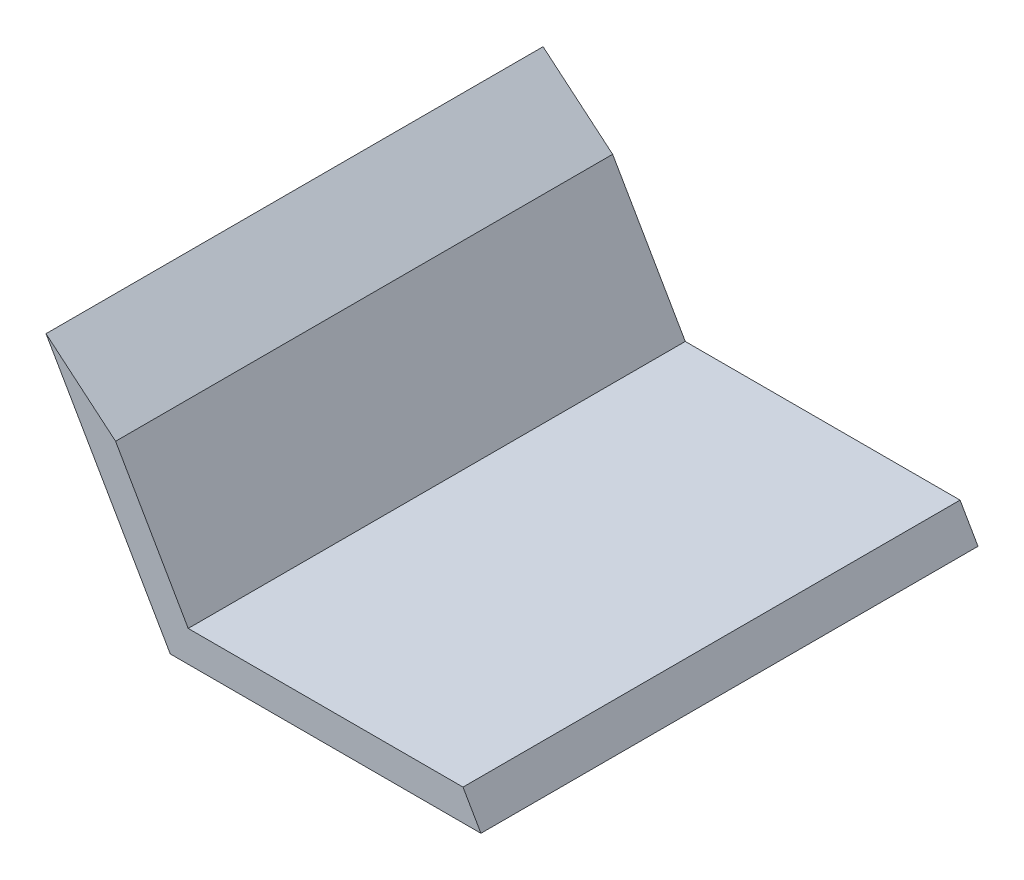
ISO-10303-21;
HEADER;
FILE_DESCRIPTION(('STEP AP214'),'2;1');
FILE_NAME('part.step','',(''),(''),'','','');
FILE_SCHEMA(('AUTOMOTIVE_DESIGN { 1 0 10303 214 1 1 1 1 }'));
ENDSEC;
DATA;
#1=APPLICATION_CONTEXT('core data for automotive mechanical design processes');
#2=APPLICATION_PROTOCOL_DEFINITION('international standard','automotive_design',2000,#1);
#3=PRODUCT_CONTEXT('',#1,'mechanical');
#4=PRODUCT('Part','Part','',(#3));
#5=PRODUCT_RELATED_PRODUCT_CATEGORY('part','',(#4));
#6=PRODUCT_DEFINITION_FORMATION('','',#4);
#7=PRODUCT_DEFINITION_CONTEXT('part definition',#1,'design');
#8=PRODUCT_DEFINITION('design','',#6,#7);
#9=PRODUCT_DEFINITION_SHAPE('','',#8);
#10=(LENGTH_UNIT() NAMED_UNIT(*) SI_UNIT(.MILLI.,.METRE.));
#11=(NAMED_UNIT(*) PLANE_ANGLE_UNIT() SI_UNIT($,.RADIAN.));
#12=(NAMED_UNIT(*) SI_UNIT($,.STERADIAN.) SOLID_ANGLE_UNIT());
#13=UNCERTAINTY_MEASURE_WITH_UNIT(LENGTH_MEASURE(1.E-05),#10,'distance_accuracy_value','');
#14=(GEOMETRIC_REPRESENTATION_CONTEXT(3) GLOBAL_UNCERTAINTY_ASSIGNED_CONTEXT((#13)) GLOBAL_UNIT_ASSIGNED_CONTEXT((#10,
#11,#12)) REPRESENTATION_CONTEXT('',''));
#15=CARTESIAN_POINT('',(0.,0.,0.));
#16=DIRECTION('',(0.,0.,1.));
#17=DIRECTION('',(1.,0.,0.));
#18=AXIS2_PLACEMENT_3D('',#15,#16,#17);
#19=CARTESIAN_POINT('',(15.875,0.,25.4));
#20=DIRECTION('',(0.,1.,0.));
#21=DIRECTION('',(-1.,0.,0.));
#22=AXIS2_PLACEMENT_3D('',#19,#20,#21);
#23=PLANE('',#22);
#24=DIRECTION('',(1.,0.,0.));
#25=VECTOR('',#24,1.);
#26=CARTESIAN_POINT('',(15.875,0.,0.));
#27=LINE('',#26,#25);
#28=CARTESIAN_POINT('',(0.,0.,0.));
#29=VERTEX_POINT('',#28);
#30=CARTESIAN_POINT('',(15.875,0.,0.));
#31=VERTEX_POINT('',#30);
#32=EDGE_CURVE('E107',#29,#31,#27,.T.);
#33=ORIENTED_EDGE('',*,*,#32,.T.);
#34=DIRECTION('',(0.,0.,-1.));
#35=VECTOR('',#34,1.);
#36=CARTESIAN_POINT('',(15.875,0.,25.4));
#37=LINE('',#36,#35);
#38=CARTESIAN_POINT('',(15.875,0.,25.4));
#39=VERTEX_POINT('',#38);
#40=EDGE_CURVE('E11',#39,#31,#37,.T.);
#41=ORIENTED_EDGE('',*,*,#40,.F.);
#42=DIRECTION('',(1.,0.,0.));
#43=VECTOR('',#42,1.);
#44=CARTESIAN_POINT('',(15.875,0.,25.4));
#45=LINE('',#44,#43);
#46=CARTESIAN_POINT('',(0.,0.,25.4));
#47=VERTEX_POINT('',#46);
#48=EDGE_CURVE('E108',#47,#39,#45,.T.);
#49=ORIENTED_EDGE('',*,*,#48,.F.);
#50=DIRECTION('',(0.,0.,-1.));
#51=VECTOR('',#50,1.);
#52=CARTESIAN_POINT('',(0.,0.,25.4));
#53=LINE('',#52,#51);
#54=EDGE_CURVE('E102',#47,#29,#53,.T.);
#55=ORIENTED_EDGE('',*,*,#54,.T.);
#56=EDGE_LOOP('',(#33,#41,#49,#55));
#57=FACE_BOUND('',#56,.T.);
#58=ADVANCED_FACE('F33',(#57),#23,.F.);
#59=CARTESIAN_POINT('',(15.875,0.,25.4));
#60=DIRECTION('',(-0.866025403784439,-0.499999999999998,0.));
#61=DIRECTION('',(0.499999999999999,-0.86602540378444,0.));
#62=AXIS2_PLACEMENT_3D('',#59,#60,#61);
#63=PLANE('',#62);
#64=DIRECTION('',(-0.499999999999998,0.866025403784439,0.));
#65=VECTOR('',#64,1.);
#66=CARTESIAN_POINT('',(15.875,0.,0.));
#67=LINE('',#66,#65);
#68=CARTESIAN_POINT('',(14.9584564476615,1.5875,0.));
#69=VERTEX_POINT('',#68);
#70=EDGE_CURVE('E125',#31,#69,#67,.T.);
#71=ORIENTED_EDGE('',*,*,#70,.T.);
#72=DIRECTION('',(0.,0.,-1.));
#73=VECTOR('',#72,1.);
#74=CARTESIAN_POINT('',(14.9584564476615,1.5875,25.4));
#75=LINE('',#74,#73);
#76=CARTESIAN_POINT('',(14.9584564476615,1.5875,25.4));
#77=VERTEX_POINT('',#76);
#78=EDGE_CURVE('E40',#77,#69,#75,.T.);
#79=ORIENTED_EDGE('',*,*,#78,.F.);
#80=DIRECTION('',(-0.499999999999998,0.866025403784439,0.));
#81=VECTOR('',#80,1.);
#82=CARTESIAN_POINT('',(15.875,0.,25.4));
#83=LINE('',#82,#81);
#84=EDGE_CURVE('E85',#39,#77,#83,.T.);
#85=ORIENTED_EDGE('',*,*,#84,.F.);
#86=ORIENTED_EDGE('',*,*,#40,.T.);
#87=EDGE_LOOP('',(#71,#79,#85,#86));
#88=FACE_BOUND('',#87,.T.);
#89=ADVANCED_FACE('F143',(#88),#63,.F.);
#90=CARTESIAN_POINT('',(0.916543552338537,1.5875,25.4));
#91=DIRECTION('',(0.,-1.,0.));
#92=DIRECTION('',(0.,0.,-1.));
#93=AXIS2_PLACEMENT_3D('',#90,#91,#92);
#94=PLANE('',#93);
#95=DIRECTION('',(-1.,0.,0.));
#96=VECTOR('',#95,1.);
#97=CARTESIAN_POINT('',(0.916543552338537,1.5875,0.));
#98=LINE('',#97,#96);
#99=CARTESIAN_POINT('',(0.916543552338537,1.5875,0.));
#100=VERTEX_POINT('',#99);
#101=EDGE_CURVE('E112',#69,#100,#98,.T.);
#102=ORIENTED_EDGE('',*,*,#101,.T.);
#103=DIRECTION('',(0.,0.,-1.));
#104=VECTOR('',#103,1.);
#105=CARTESIAN_POINT('',(0.916543552338537,1.5875,25.4));
#106=LINE('',#105,#104);
#107=CARTESIAN_POINT('',(0.916543552338537,1.5875,25.4));
#108=VERTEX_POINT('',#107);
#109=EDGE_CURVE('E101',#108,#100,#106,.T.);
#110=ORIENTED_EDGE('',*,*,#109,.F.);
#111=DIRECTION('',(-1.,0.,0.));
#112=VECTOR('',#111,1.);
#113=CARTESIAN_POINT('',(0.916543552338537,1.5875,25.4));
#114=LINE('',#113,#112);
#115=EDGE_CURVE('E124',#77,#108,#114,.T.);
#116=ORIENTED_EDGE('',*,*,#115,.F.);
#117=ORIENTED_EDGE('',*,*,#78,.T.);
#118=EDGE_LOOP('',(#102,#110,#116,#117));
#119=FACE_BOUND('',#118,.T.);
#120=ADVANCED_FACE('F122',(#119),#94,.F.);
#121=CARTESIAN_POINT('',(-4.51691289532291,10.9985226280624,25.4));
#122=DIRECTION('',(-0.86602540378444,-0.499999999999998,0.));
#123=DIRECTION('',(0.499999999999998,-0.86602540378444,0.));
#124=AXIS2_PLACEMENT_3D('',#121,#122,#123);
#125=PLANE('',#124);
#126=DIRECTION('',(-0.499999999999998,0.86602540378444,0.));
#127=VECTOR('',#126,1.);
#128=CARTESIAN_POINT('',(-4.51691289532291,10.9985226280624,0.));
#129=LINE('',#128,#127);
#130=CARTESIAN_POINT('',(-2.79437446980014,8.01499855706722,0.));
#131=VERTEX_POINT('',#130);
#132=EDGE_CURVE('E109',#100,#131,#129,.T.);
#133=ORIENTED_EDGE('',*,*,#132,.T.);
#134=DIRECTION('',(0.,0.,1.));
#135=VECTOR('',#134,1.);
#136=CARTESIAN_POINT('',(-2.79437446980017,8.01499855706724,0.));
#137=LINE('',#136,#135);
#138=CARTESIAN_POINT('',(-2.79437446980017,8.01499855706724,25.4));
#139=VERTEX_POINT('',#138);
#140=EDGE_CURVE('E47',#131,#139,#137,.T.);
#141=ORIENTED_EDGE('',*,*,#140,.T.);
#142=DIRECTION('',(-0.499999999999998,0.86602540378444,0.));
#143=VECTOR('',#142,1.);
#144=CARTESIAN_POINT('',(-4.51691289532291,10.9985226280624,25.4));
#145=LINE('',#144,#143);
#146=EDGE_CURVE('E130',#108,#139,#145,.T.);
#147=ORIENTED_EDGE('',*,*,#146,.F.);
#148=ORIENTED_EDGE('',*,*,#109,.T.);
#149=EDGE_LOOP('',(#133,#141,#147,#148));
#150=FACE_BOUND('',#149,.T.);
#151=ADVANCED_FACE('F138',(#150),#125,.F.);
#152=CARTESIAN_POINT('',(0.,0.,25.4));
#153=DIRECTION('',(0.86602540378444,0.499999999999998,0.));
#154=DIRECTION('',(-0.499999999999998,0.86602540378444,0.));
#155=AXIS2_PLACEMENT_3D('',#152,#153,#154);
#156=PLANE('',#155);
#157=DIRECTION('',(0.499999999999998,-0.86602540378444,0.));
#158=VECTOR('',#157,1.);
#159=CARTESIAN_POINT('',(0.,0.,0.));
#160=LINE('',#159,#158);
#161=CARTESIAN_POINT('',(-6.34999999999998,10.9985226280624,0.));
#162=VERTEX_POINT('',#161);
#163=EDGE_CURVE('E78',#162,#29,#160,.T.);
#164=ORIENTED_EDGE('',*,*,#163,.T.);
#165=ORIENTED_EDGE('',*,*,#54,.F.);
#166=DIRECTION('',(0.499999999999998,-0.86602540378444,0.));
#167=VECTOR('',#166,1.);
#168=CARTESIAN_POINT('',(0.,0.,25.4));
#169=LINE('',#168,#167);
#170=CARTESIAN_POINT('',(-6.34999999999998,10.9985226280624,25.4));
#171=VERTEX_POINT('',#170);
#172=EDGE_CURVE('E56',#171,#47,#169,.T.);
#173=ORIENTED_EDGE('',*,*,#172,.F.);
#174=DIRECTION('',(0.,0.,-1.));
#175=VECTOR('',#174,1.);
#176=CARTESIAN_POINT('',(-6.34999999999998,10.9985226280624,25.4));
#177=LINE('',#176,#175);
#178=EDGE_CURVE('E94',#171,#162,#177,.T.);
#179=ORIENTED_EDGE('',*,*,#178,.T.);
#180=EDGE_LOOP('',(#164,#165,#173,#179));
#181=FACE_BOUND('',#180,.T.);
#182=ADVANCED_FACE('F100',(#181),#156,.F.);
#183=CARTESIAN_POINT('',(0.,0.,25.4));
#184=DIRECTION('',(0.,0.,-1.));
#185=DIRECTION('',(-1.,0.,0.));
#186=AXIS2_PLACEMENT_3D('',#183,#184,#185);
#187=PLANE('',#186);
#188=ORIENTED_EDGE('',*,*,#146,.T.);
#189=DIRECTION('',(0.766044443118982,-0.642787609686535,0.));
#190=VECTOR('',#189,1.);
#191=CARTESIAN_POINT('',(-6.34999999999998,10.9985226280624,25.4));
#192=LINE('',#191,#190);
#193=EDGE_CURVE('E98',#171,#139,#192,.T.);
#194=ORIENTED_EDGE('',*,*,#193,.F.);
#195=ORIENTED_EDGE('',*,*,#172,.T.);
#196=ORIENTED_EDGE('',*,*,#48,.T.);
#197=ORIENTED_EDGE('',*,*,#84,.T.);
#198=ORIENTED_EDGE('',*,*,#115,.T.);
#199=EDGE_LOOP('',(#188,#194,#195,#196,#197,#198));
#200=FACE_BOUND('',#199,.T.);
#201=ADVANCED_FACE('F139',(#200),#187,.F.);
#202=CARTESIAN_POINT('',(0.,0.,0.));
#203=DIRECTION('',(0.,0.,-1.));
#204=DIRECTION('',(-1.,0.,0.));
#205=AXIS2_PLACEMENT_3D('',#202,#203,#204);
#206=PLANE('',#205);
#207=DIRECTION('',(0.766044443118982,-0.642787609686535,0.));
#208=VECTOR('',#207,1.);
#209=CARTESIAN_POINT('',(-6.34999999999998,10.9985226280624,0.));
#210=LINE('',#209,#208);
#211=EDGE_CURVE('E92',#162,#131,#210,.T.);
#212=ORIENTED_EDGE('',*,*,#211,.T.);
#213=ORIENTED_EDGE('',*,*,#132,.F.);
#214=ORIENTED_EDGE('',*,*,#101,.F.);
#215=ORIENTED_EDGE('',*,*,#70,.F.);
#216=ORIENTED_EDGE('',*,*,#32,.F.);
#217=ORIENTED_EDGE('',*,*,#163,.F.);
#218=EDGE_LOOP('',(#212,#213,#214,#215,#216,#217));
#219=FACE_BOUND('',#218,.T.);
#220=ADVANCED_FACE('F105',(#219),#206,.T.);
#221=CARTESIAN_POINT('',(-6.34999999999998,10.9985226280624,0.));
#222=DIRECTION('',(-0.642787609686535,-0.766044443118982,0.));
#223=DIRECTION('',(0.766044443118982,-0.642787609686535,0.));
#224=AXIS2_PLACEMENT_3D('',#221,#222,#223);
#225=PLANE('',#224);
#226=ORIENTED_EDGE('',*,*,#193,.T.);
#227=ORIENTED_EDGE('',*,*,#140,.F.);
#228=ORIENTED_EDGE('',*,*,#211,.F.);
#229=ORIENTED_EDGE('',*,*,#178,.F.);
#230=EDGE_LOOP('',(#226,#227,#228,#229));
#231=FACE_BOUND('',#230,.T.);
#232=ADVANCED_FACE('F93',(#231),#225,.F.);
#233=CLOSED_SHELL('',(#58,#89,#120,#151,#182,#201,#220,#232));
#234=MANIFOLD_SOLID_BREP('B2',#233);
#235=ADVANCED_BREP_SHAPE_REPRESENTATION('',(#18,#234),#14);
#236=SHAPE_DEFINITION_REPRESENTATION(#9,#235);
ENDSEC;
END-ISO-10303-21;
